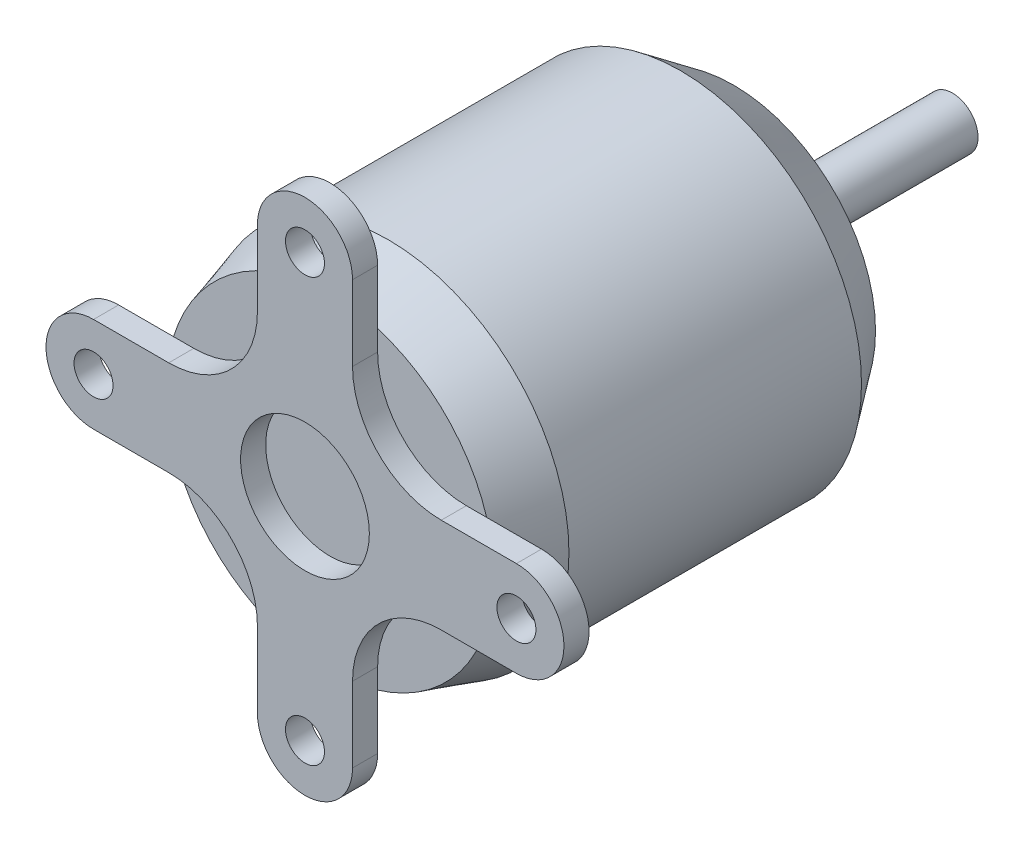
ISO-10303-21;
HEADER;
FILE_DESCRIPTION(('STEP AP214'),'2;1');
FILE_NAME('part.step','',(''),(''),'','','');
FILE_SCHEMA(('AUTOMOTIVE_DESIGN { 1 0 10303 214 1 1 1 1 }'));
ENDSEC;
DATA;
#1=APPLICATION_CONTEXT('core data for automotive mechanical design processes');
#2=APPLICATION_PROTOCOL_DEFINITION('international standard','automotive_design',2000,#1);
#3=PRODUCT_CONTEXT('',#1,'mechanical');
#4=PRODUCT('Part','Part','',(#3));
#5=PRODUCT_RELATED_PRODUCT_CATEGORY('part','',(#4));
#6=PRODUCT_DEFINITION_FORMATION('','',#4);
#7=PRODUCT_DEFINITION_CONTEXT('part definition',#1,'design');
#8=PRODUCT_DEFINITION('design','',#6,#7);
#9=PRODUCT_DEFINITION_SHAPE('','',#8);
#10=(LENGTH_UNIT() NAMED_UNIT(*) SI_UNIT(.MILLI.,.METRE.));
#11=(NAMED_UNIT(*) PLANE_ANGLE_UNIT() SI_UNIT($,.RADIAN.));
#12=(NAMED_UNIT(*) SI_UNIT($,.STERADIAN.) SOLID_ANGLE_UNIT());
#13=UNCERTAINTY_MEASURE_WITH_UNIT(LENGTH_MEASURE(1.E-05),#10,'distance_accuracy_value','');
#14=(GEOMETRIC_REPRESENTATION_CONTEXT(3) GLOBAL_UNCERTAINTY_ASSIGNED_CONTEXT((#13)) GLOBAL_UNIT_ASSIGNED_CONTEXT((#10,
#11,#12)) REPRESENTATION_CONTEXT('',''));
#15=CARTESIAN_POINT('',(0.,0.,0.));
#16=DIRECTION('',(0.,0.,1.));
#17=DIRECTION('',(1.,0.,0.));
#18=AXIS2_PLACEMENT_3D('',#15,#16,#17);
#19=CARTESIAN_POINT('',(0.,0.,0.));
#20=DIRECTION('',(0.,0.,1.));
#21=DIRECTION('',(1.,0.,0.));
#22=AXIS2_PLACEMENT_3D('',#19,#20,#21);
#23=PLANE('',#22);
#24=CARTESIAN_POINT('',(10.4834809732489,10.4834809732489,0.));
#25=DIRECTION('',(0.,0.,1.));
#26=DIRECTION('',(1.,0.,0.));
#27=AXIS2_PLACEMENT_3D('',#24,#25,#26);
#28=CIRCLE('',#27,6.82588097324893);
#29=CARTESIAN_POINT('',(3.6576,10.4834809732489,0.));
#30=VERTEX_POINT('',#29);
#31=CARTESIAN_POINT('',(10.4834809732489,3.65759999999996,0.));
#32=VERTEX_POINT('',#31);
#33=EDGE_CURVE('E51',#30,#32,#28,.T.);
#34=ORIENTED_EDGE('',*,*,#33,.T.);
#35=DIRECTION('',(-1.,0.,0.));
#36=VECTOR('',#35,1.);
#37=CARTESIAN_POINT('',(0.,3.6576,0.));
#38=LINE('',#37,#36);
#39=CARTESIAN_POINT('',(12.0425000199294,3.65759999999996,0.));
#40=VERTEX_POINT('',#39);
#41=EDGE_CURVE('E289',#40,#32,#38,.T.);
#42=ORIENTED_EDGE('',*,*,#41,.F.);
#43=CARTESIAN_POINT('',(0.,0.,0.));
#44=DIRECTION('',(0.,0.,-1.));
#45=DIRECTION('',(-1.,0.,0.));
#46=AXIS2_PLACEMENT_3D('',#43,#44,#45);
#47=CIRCLE('',#46,12.5857);
#48=CARTESIAN_POINT('',(3.6576,12.0425000199294,0.));
#49=VERTEX_POINT('',#48);
#50=EDGE_CURVE('E375',#49,#40,#47,.T.);
#51=ORIENTED_EDGE('',*,*,#50,.F.);
#52=DIRECTION('',(0.,-1.,0.));
#53=VECTOR('',#52,1.);
#54=CARTESIAN_POINT('',(3.6576,0.,0.));
#55=LINE('',#54,#53);
#56=EDGE_CURVE('E42',#49,#30,#55,.T.);
#57=ORIENTED_EDGE('',*,*,#56,.T.);
#58=EDGE_LOOP('',(#34,#42,#51,#57));
#59=FACE_BOUND('',#58,.T.);
#60=ADVANCED_FACE('F33',(#59),#23,.T.);
#61=CARTESIAN_POINT('',(0.,0.,0.));
#62=DIRECTION('',(0.,0.,1.));
#63=DIRECTION('',(1.,0.,0.));
#64=AXIS2_PLACEMENT_3D('',#61,#62,#63);
#65=CIRCLE('',#64,4.953);
#66=CARTESIAN_POINT('',(4.953,0.,0.));
#67=VERTEX_POINT('',#66);
#68=EDGE_CURVE('E324',#67,#67,#65,.T.);
#69=ORIENTED_EDGE('',*,*,#68,.T.);
#70=EDGE_LOOP('',(#69));
#71=FACE_BOUND('',#70,.T.);
#72=ADVANCED_FACE('F462',(#71),#23,.T.);
#73=DIRECTION('',(-1.,0.,0.));
#74=VECTOR('',#73,1.);
#75=CARTESIAN_POINT('',(0.,-3.6576,0.));
#76=LINE('',#75,#74);
#77=CARTESIAN_POINT('',(12.0425000199294,-3.65760000000004,0.));
#78=VERTEX_POINT('',#77);
#79=CARTESIAN_POINT('',(10.4834809732489,-3.65760000000004,0.));
#80=VERTEX_POINT('',#79);
#81=EDGE_CURVE('E59',#78,#80,#76,.T.);
#82=ORIENTED_EDGE('',*,*,#81,.T.);
#83=CARTESIAN_POINT('',(10.4834809732489,-10.483480973249,0.));
#84=DIRECTION('',(0.,0.,1.));
#85=DIRECTION('',(0.,-1.,0.));
#86=AXIS2_PLACEMENT_3D('',#83,#84,#85);
#87=CIRCLE('',#86,6.82588097324893);
#88=CARTESIAN_POINT('',(3.6576,-10.4834809732489,0.));
#89=VERTEX_POINT('',#88);
#90=EDGE_CURVE('E268',#80,#89,#87,.T.);
#91=ORIENTED_EDGE('',*,*,#90,.T.);
#92=DIRECTION('',(0.,1.,0.));
#93=VECTOR('',#92,1.);
#94=CARTESIAN_POINT('',(3.6576,0.,0.));
#95=LINE('',#94,#93);
#96=CARTESIAN_POINT('',(3.6576,-12.0425000199294,0.));
#97=VERTEX_POINT('',#96);
#98=EDGE_CURVE('E252',#97,#89,#95,.T.);
#99=ORIENTED_EDGE('',*,*,#98,.F.);
#100=EDGE_CURVE('E374',#78,#97,#47,.T.);
#101=ORIENTED_EDGE('',*,*,#100,.F.);
#102=EDGE_LOOP('',(#82,#91,#99,#101));
#103=FACE_BOUND('',#102,.T.);
#104=ADVANCED_FACE('F460',(#103),#23,.T.);
#105=DIRECTION('',(1.,0.,0.));
#106=VECTOR('',#105,1.);
#107=CARTESIAN_POINT('',(0.,3.6576,0.));
#108=LINE('',#107,#106);
#109=CARTESIAN_POINT('',(-12.0425000199294,3.65760000000013,0.));
#110=VERTEX_POINT('',#109);
#111=CARTESIAN_POINT('',(-10.4834809732489,3.65760000000011,0.));
#112=VERTEX_POINT('',#111);
#113=EDGE_CURVE('E219',#110,#112,#108,.T.);
#114=ORIENTED_EDGE('',*,*,#113,.T.);
#115=CARTESIAN_POINT('',(-10.4834809732489,10.4834809732489,0.));
#116=DIRECTION('',(0.,0.,1.));
#117=DIRECTION('',(1.,0.,0.));
#118=AXIS2_PLACEMENT_3D('',#115,#116,#117);
#119=CIRCLE('',#118,6.82588097324893);
#120=CARTESIAN_POINT('',(-3.6576,10.4834809732489,0.));
#121=VERTEX_POINT('',#120);
#122=EDGE_CURVE('E190',#121,#112,#119,.F.);
#123=ORIENTED_EDGE('',*,*,#122,.F.);
#124=DIRECTION('',(0.,-1.,0.));
#125=VECTOR('',#124,1.);
#126=CARTESIAN_POINT('',(-3.6576,0.,0.));
#127=LINE('',#126,#125);
#128=CARTESIAN_POINT('',(-3.6576,12.0425000199294,0.));
#129=VERTEX_POINT('',#128);
#130=EDGE_CURVE('E11',#129,#121,#127,.T.);
#131=ORIENTED_EDGE('',*,*,#130,.F.);
#132=EDGE_CURVE('E365',#110,#129,#47,.T.);
#133=ORIENTED_EDGE('',*,*,#132,.F.);
#134=EDGE_LOOP('',(#114,#123,#131,#133));
#135=FACE_BOUND('',#134,.T.);
#136=ADVANCED_FACE('F421',(#135),#23,.T.);
#137=DIRECTION('',(0.,1.,0.));
#138=VECTOR('',#137,1.);
#139=CARTESIAN_POINT('',(-3.6576,0.,0.));
#140=LINE('',#139,#138);
#141=CARTESIAN_POINT('',(-3.6576,-12.0425000199294,0.));
#142=VERTEX_POINT('',#141);
#143=CARTESIAN_POINT('',(-3.6576,-10.4834809732489,0.));
#144=VERTEX_POINT('',#143);
#145=EDGE_CURVE('E246',#142,#144,#140,.T.);
#146=ORIENTED_EDGE('',*,*,#145,.T.);
#147=CARTESIAN_POINT('',(-10.4834809732489,-10.4834809732489,0.));
#148=DIRECTION('',(0.,0.,1.));
#149=DIRECTION('',(-1.,0.,0.));
#150=AXIS2_PLACEMENT_3D('',#147,#148,#149);
#151=CIRCLE('',#150,6.82588097324893);
#152=CARTESIAN_POINT('',(-10.483480973249,-3.65759999999989,0.));
#153=VERTEX_POINT('',#152);
#154=EDGE_CURVE('E194',#144,#153,#151,.T.);
#155=ORIENTED_EDGE('',*,*,#154,.T.);
#156=DIRECTION('',(1.,0.,0.));
#157=VECTOR('',#156,1.);
#158=CARTESIAN_POINT('',(0.,-3.6576,0.));
#159=LINE('',#158,#157);
#160=CARTESIAN_POINT('',(-12.0425000199295,-3.65759999999987,0.));
#161=VERTEX_POINT('',#160);
#162=EDGE_CURVE('E221',#161,#153,#159,.T.);
#163=ORIENTED_EDGE('',*,*,#162,.F.);
#164=EDGE_CURVE('E368',#142,#161,#47,.T.);
#165=ORIENTED_EDGE('',*,*,#164,.F.);
#166=EDGE_LOOP('',(#146,#155,#163,#165));
#167=FACE_BOUND('',#166,.T.);
#168=ADVANCED_FACE('F35',(#167),#23,.T.);
#169=CARTESIAN_POINT('',(0.,0.,-4.4704));
#170=DIRECTION('',(0.,0.,-1.));
#171=DIRECTION('',(-1.,0.,0.));
#172=AXIS2_PLACEMENT_3D('',#169,#170,#171);
#173=CONICAL_SURFACE('',#172,13.9065,0.287281453397134);
#174=EDGE_CURVE('E37',#129,#49,#47,.T.);
#175=ORIENTED_EDGE('',*,*,#174,.T.);
#176=ORIENTED_EDGE('',*,*,#50,.T.);
#177=CARTESIAN_POINT('',(0.,0.,0.));
#178=DIRECTION('',(0.,0.,1.));
#179=DIRECTION('',(1.,0.,0.));
#180=AXIS2_PLACEMENT_3D('',#177,#178,#179);
#181=CIRCLE('',#180,12.5857);
#182=EDGE_CURVE('E304',#40,#78,#181,.F.);
#183=ORIENTED_EDGE('',*,*,#182,.T.);
#184=ORIENTED_EDGE('',*,*,#100,.T.);
#185=EDGE_CURVE('E308',#97,#142,#181,.F.);
#186=ORIENTED_EDGE('',*,*,#185,.T.);
#187=ORIENTED_EDGE('',*,*,#164,.T.);
#188=EDGE_CURVE('E307',#161,#110,#181,.F.);
#189=ORIENTED_EDGE('',*,*,#188,.T.);
#190=ORIENTED_EDGE('',*,*,#132,.T.);
#191=EDGE_LOOP('',(#175,#176,#183,#184,#186,#187,#189,#190));
#192=FACE_BOUND('',#191,.T.);
#193=CARTESIAN_POINT('',(0.,0.,-4.4704));
#194=DIRECTION('',(0.,0.,-1.));
#195=DIRECTION('',(-1.,0.,0.));
#196=AXIS2_PLACEMENT_3D('',#193,#194,#195);
#197=CIRCLE('',#196,13.9065);
#198=CARTESIAN_POINT('',(-13.9065,0.,-4.4704));
#199=VERTEX_POINT('',#198);
#200=EDGE_CURVE('E363',#199,#199,#197,.T.);
#201=ORIENTED_EDGE('',*,*,#200,.F.);
#202=EDGE_LOOP('',(#201));
#203=FACE_BOUND('',#202,.T.);
#204=ADVANCED_FACE('F383',(#192,#203),#173,.T.);
#205=CARTESIAN_POINT('',(0.,0.,0.));
#206=DIRECTION('',(0.,0.,-1.));
#207=DIRECTION('',(-1.,0.,0.));
#208=AXIS2_PLACEMENT_3D('',#205,#206,#207);
#209=CYLINDRICAL_SURFACE('',#208,13.9065);
#210=ORIENTED_EDGE('',*,*,#200,.T.);
#211=EDGE_LOOP('',(#210));
#212=FACE_BOUND('',#211,.T.);
#213=CARTESIAN_POINT('',(0.,0.,-26.9748));
#214=DIRECTION('',(0.,0.,-1.));
#215=DIRECTION('',(-1.,0.,0.));
#216=AXIS2_PLACEMENT_3D('',#213,#214,#215);
#217=CIRCLE('',#216,13.9065);
#218=CARTESIAN_POINT('',(-13.9065,0.,-26.9748));
#219=VERTEX_POINT('',#218);
#220=EDGE_CURVE('E361',#219,#219,#217,.T.);
#221=ORIENTED_EDGE('',*,*,#220,.F.);
#222=EDGE_LOOP('',(#221));
#223=FACE_BOUND('',#222,.T.);
#224=ADVANCED_FACE('F475',(#212,#223),#209,.T.);
#225=CARTESIAN_POINT('',(0.,0.,-31.0388));
#226=DIRECTION('',(0.,0.,1.));
#227=DIRECTION('',(1.,0.,0.));
#228=AXIS2_PLACEMENT_3D('',#225,#226,#227);
#229=CONICAL_SURFACE('',#228,10.922,0.633425882969144);
#230=ORIENTED_EDGE('',*,*,#220,.T.);
#231=EDGE_LOOP('',(#230));
#232=FACE_BOUND('',#231,.T.);
#233=CARTESIAN_POINT('',(0.,0.,-31.0388));
#234=DIRECTION('',(0.,0.,-1.));
#235=DIRECTION('',(-1.,0.,0.));
#236=AXIS2_PLACEMENT_3D('',#233,#234,#235);
#237=CIRCLE('',#236,10.922);
#238=CARTESIAN_POINT('',(-10.922,0.,-31.0388));
#239=VERTEX_POINT('',#238);
#240=EDGE_CURVE('E358',#239,#239,#237,.T.);
#241=ORIENTED_EDGE('',*,*,#240,.F.);
#242=EDGE_LOOP('',(#241));
#243=FACE_BOUND('',#242,.T.);
#244=ADVANCED_FACE('F479',(#232,#243),#229,.T.);
#245=CARTESIAN_POINT('',(0.,10.922,-31.0388));
#246=DIRECTION('',(0.,0.,-1.));
#247=DIRECTION('',(-1.,0.,0.));
#248=AXIS2_PLACEMENT_3D('',#245,#246,#247);
#249=PLANE('',#248);
#250=ORIENTED_EDGE('',*,*,#240,.T.);
#251=EDGE_LOOP('',(#250));
#252=FACE_BOUND('',#251,.T.);
#253=CARTESIAN_POINT('',(0.,0.,-31.0388));
#254=DIRECTION('',(0.,0.,-1.));
#255=DIRECTION('',(-1.,0.,0.));
#256=AXIS2_PLACEMENT_3D('',#253,#254,#255);
#257=CIRCLE('',#256,4.50215);
#258=CARTESIAN_POINT('',(-4.50215,0.,-31.0388));
#259=VERTEX_POINT('',#258);
#260=EDGE_CURVE('E355',#259,#259,#257,.T.);
#261=ORIENTED_EDGE('',*,*,#260,.F.);
#262=EDGE_LOOP('',(#261));
#263=FACE_BOUND('',#262,.T.);
#264=ADVANCED_FACE('F484',(#252,#263),#249,.T.);
#265=CARTESIAN_POINT('',(0.,0.,0.));
#266=DIRECTION('',(0.,0.,-1.));
#267=DIRECTION('',(-1.,0.,0.));
#268=AXIS2_PLACEMENT_3D('',#265,#266,#267);
#269=CYLINDRICAL_SURFACE('',#268,4.50215);
#270=ORIENTED_EDGE('',*,*,#260,.T.);
#271=EDGE_LOOP('',(#270));
#272=FACE_BOUND('',#271,.T.);
#273=CARTESIAN_POINT('',(0.,0.,-34.9758));
#274=DIRECTION('',(0.,0.,-1.));
#275=DIRECTION('',(-1.,0.,0.));
#276=AXIS2_PLACEMENT_3D('',#273,#274,#275);
#277=CIRCLE('',#276,4.50215);
#278=CARTESIAN_POINT('',(-4.50215,0.,-34.9758));
#279=VERTEX_POINT('',#278);
#280=EDGE_CURVE('E352',#279,#279,#277,.T.);
#281=ORIENTED_EDGE('',*,*,#280,.F.);
#282=EDGE_LOOP('',(#281));
#283=FACE_BOUND('',#282,.T.);
#284=ADVANCED_FACE('F488',(#272,#283),#269,.T.);
#285=CARTESIAN_POINT('',(0.,4.50215,-34.9758));
#286=DIRECTION('',(0.,0.,-1.));
#287=DIRECTION('',(-1.,0.,0.));
#288=AXIS2_PLACEMENT_3D('',#285,#286,#287);
#289=PLANE('',#288);
#290=ORIENTED_EDGE('',*,*,#280,.T.);
#291=EDGE_LOOP('',(#290));
#292=FACE_BOUND('',#291,.T.);
#293=CARTESIAN_POINT('',(0.,0.,-34.9758));
#294=DIRECTION('',(0.,0.,-1.));
#295=DIRECTION('',(-1.,0.,0.));
#296=AXIS2_PLACEMENT_3D('',#293,#294,#295);
#297=CIRCLE('',#296,1.9685);
#298=CARTESIAN_POINT('',(-1.9685,0.,-34.9758));
#299=VERTEX_POINT('',#298);
#300=EDGE_CURVE('E349',#299,#299,#297,.T.);
#301=ORIENTED_EDGE('',*,*,#300,.F.);
#302=EDGE_LOOP('',(#301));
#303=FACE_BOUND('',#302,.T.);
#304=ADVANCED_FACE('F492',(#292,#303),#289,.T.);
#305=CARTESIAN_POINT('',(0.,0.,0.));
#306=DIRECTION('',(0.,0.,-1.));
#307=DIRECTION('',(-1.,0.,0.));
#308=AXIS2_PLACEMENT_3D('',#305,#306,#307);
#309=CYLINDRICAL_SURFACE('',#308,1.9685);
#310=ORIENTED_EDGE('',*,*,#300,.T.);
#311=EDGE_LOOP('',(#310));
#312=FACE_BOUND('',#311,.T.);
#313=CARTESIAN_POINT('',(0.,0.,-47.879));
#314=DIRECTION('',(0.,0.,-1.));
#315=DIRECTION('',(-1.,0.,0.));
#316=AXIS2_PLACEMENT_3D('',#313,#314,#315);
#317=CIRCLE('',#316,1.9685);
#318=CARTESIAN_POINT('',(-1.9685,0.,-47.879));
#319=VERTEX_POINT('',#318);
#320=EDGE_CURVE('E346',#319,#319,#317,.T.);
#321=ORIENTED_EDGE('',*,*,#320,.F.);
#322=EDGE_LOOP('',(#321));
#323=FACE_BOUND('',#322,.T.);
#324=ADVANCED_FACE('F496',(#312,#323),#309,.T.);
#325=CARTESIAN_POINT('',(0.,1.9685,-47.879));
#326=DIRECTION('',(0.,0.,-1.));
#327=DIRECTION('',(-1.,0.,0.));
#328=AXIS2_PLACEMENT_3D('',#325,#326,#327);
#329=PLANE('',#328);
#330=ORIENTED_EDGE('',*,*,#320,.T.);
#331=EDGE_LOOP('',(#330));
#332=FACE_BOUND('',#331,.T.);
#333=ADVANCED_FACE('F500',(#332),#329,.T.);
#334=CARTESIAN_POINT('',(0.,0.,1.9304));
#335=DIRECTION('',(0.,0.,-1.));
#336=DIRECTION('',(-1.,0.,0.));
#337=AXIS2_PLACEMENT_3D('',#334,#335,#336);
#338=CYLINDRICAL_SURFACE('',#337,4.953);
#339=ORIENTED_EDGE('',*,*,#68,.F.);
#340=EDGE_LOOP('',(#339));
#341=FACE_BOUND('',#340,.T.);
#342=CARTESIAN_POINT('',(0.,0.,1.9304));
#343=DIRECTION('',(0.,0.,1.));
#344=DIRECTION('',(1.,0.,0.));
#345=AXIS2_PLACEMENT_3D('',#342,#343,#344);
#346=CIRCLE('',#345,4.953);
#347=CARTESIAN_POINT('',(4.953,0.,1.9304));
#348=VERTEX_POINT('',#347);
#349=EDGE_CURVE('E309',#348,#348,#346,.T.);
#350=ORIENTED_EDGE('',*,*,#349,.T.);
#351=EDGE_LOOP('',(#350));
#352=FACE_BOUND('',#351,.T.);
#353=ADVANCED_FACE('F504',(#341,#352),#338,.F.);
#354=CARTESIAN_POINT('',(10.4834809732489,10.4834809732489,1.9304));
#355=DIRECTION('',(0.,0.,-1.));
#356=DIRECTION('',(-1.,0.,0.));
#357=AXIS2_PLACEMENT_3D('',#354,#355,#356);
#358=CYLINDRICAL_SURFACE('',#357,6.82588097324893);
#359=ORIENTED_EDGE('',*,*,#33,.F.);
#360=DIRECTION('',(0.,0.,-1.));
#361=VECTOR('',#360,1.);
#362=CARTESIAN_POINT('',(3.6576,10.4834809732489,1.9304));
#363=LINE('',#362,#361);
#364=CARTESIAN_POINT('',(3.6576,10.4834809732489,1.9304));
#365=VERTEX_POINT('',#364);
#366=EDGE_CURVE('E343',#365,#30,#363,.T.);
#367=ORIENTED_EDGE('',*,*,#366,.F.);
#368=CARTESIAN_POINT('',(10.4834809732489,10.4834809732489,1.9304));
#369=DIRECTION('',(0.,0.,1.));
#370=DIRECTION('',(1.,0.,0.));
#371=AXIS2_PLACEMENT_3D('',#368,#369,#370);
#372=CIRCLE('',#371,6.82588097324893);
#373=CARTESIAN_POINT('',(10.4834809732489,3.65759999999996,1.9304));
#374=VERTEX_POINT('',#373);
#375=EDGE_CURVE('E312',#365,#374,#372,.T.);
#376=ORIENTED_EDGE('',*,*,#375,.T.);
#377=DIRECTION('',(0.,0.,-1.));
#378=VECTOR('',#377,1.);
#379=CARTESIAN_POINT('',(10.4834809732489,3.65759999999996,1.9304));
#380=LINE('',#379,#378);
#381=EDGE_CURVE('E282',#374,#32,#380,.T.);
#382=ORIENTED_EDGE('',*,*,#381,.T.);
#383=EDGE_LOOP('',(#359,#367,#376,#382));
#384=FACE_BOUND('',#383,.T.);
#385=ADVANCED_FACE('F443',(#384),#358,.F.);
#386=CARTESIAN_POINT('',(3.6576,0.,1.9304));
#387=DIRECTION('',(1.,0.,0.));
#388=DIRECTION('',(0.,1.,0.));
#389=AXIS2_PLACEMENT_3D('',#386,#387,#388);
#390=PLANE('',#389);
#391=CARTESIAN_POINT('',(3.6576,16.265,0.));
#392=VERTEX_POINT('',#391);
#393=EDGE_CURVE('E328',#392,#49,#55,.T.);
#394=ORIENTED_EDGE('',*,*,#393,.F.);
#395=DIRECTION('',(0.,0.,-1.));
#396=VECTOR('',#395,1.);
#397=CARTESIAN_POINT('',(3.6576,16.265,1.9304));
#398=LINE('',#397,#396);
#399=CARTESIAN_POINT('',(3.6576,16.265,1.9304));
#400=VERTEX_POINT('',#399);
#401=EDGE_CURVE('E341',#400,#392,#398,.T.);
#402=ORIENTED_EDGE('',*,*,#401,.F.);
#403=DIRECTION('',(0.,-1.,0.));
#404=VECTOR('',#403,1.);
#405=CARTESIAN_POINT('',(3.6576,0.,1.9304));
#406=LINE('',#405,#404);
#407=EDGE_CURVE('E315',#400,#365,#406,.T.);
#408=ORIENTED_EDGE('',*,*,#407,.T.);
#409=ORIENTED_EDGE('',*,*,#366,.T.);
#410=ORIENTED_EDGE('',*,*,#56,.F.);
#411=EDGE_LOOP('',(#394,#402,#408,#409,#410));
#412=FACE_BOUND('',#411,.T.);
#413=ADVANCED_FACE('F436',(#412),#390,.T.);
#414=CARTESIAN_POINT('',(0.,16.265,1.9304));
#415=DIRECTION('',(0.,0.,-1.));
#416=DIRECTION('',(-1.,0.,0.));
#417=AXIS2_PLACEMENT_3D('',#414,#415,#416);
#418=CYLINDRICAL_SURFACE('',#417,3.6576);
#419=CARTESIAN_POINT('',(0.,16.265,0.));
#420=DIRECTION('',(0.,0.,1.));
#421=DIRECTION('',(1.,0.,0.));
#422=AXIS2_PLACEMENT_3D('',#419,#420,#421);
#423=CIRCLE('',#422,3.6576);
#424=CARTESIAN_POINT('',(-3.6576,16.265,0.));
#425=VERTEX_POINT('',#424);
#426=EDGE_CURVE('E331',#392,#425,#423,.T.);
#427=ORIENTED_EDGE('',*,*,#426,.T.);
#428=DIRECTION('',(0.,0.,-1.));
#429=VECTOR('',#428,1.);
#430=CARTESIAN_POINT('',(-3.6576,16.265,1.9304));
#431=LINE('',#430,#429);
#432=CARTESIAN_POINT('',(-3.6576,16.265,1.9304));
#433=VERTEX_POINT('',#432);
#434=EDGE_CURVE('E338',#433,#425,#431,.T.);
#435=ORIENTED_EDGE('',*,*,#434,.F.);
#436=CARTESIAN_POINT('',(0.,16.265,1.9304));
#437=DIRECTION('',(0.,0.,1.));
#438=DIRECTION('',(1.,0.,0.));
#439=AXIS2_PLACEMENT_3D('',#436,#437,#438);
#440=CIRCLE('',#439,3.6576);
#441=EDGE_CURVE('E318',#400,#433,#440,.T.);
#442=ORIENTED_EDGE('',*,*,#441,.F.);
#443=ORIENTED_EDGE('',*,*,#401,.T.);
#444=EDGE_LOOP('',(#427,#435,#442,#443));
#445=FACE_BOUND('',#444,.T.);
#446=ADVANCED_FACE('F433',(#445),#418,.T.);
#447=CARTESIAN_POINT('',(-3.6576,0.,1.9304));
#448=DIRECTION('',(1.,0.,0.));
#449=DIRECTION('',(0.,0.,-1.));
#450=AXIS2_PLACEMENT_3D('',#447,#448,#449);
#451=PLANE('',#450);
#452=EDGE_CURVE('E44',#425,#129,#127,.T.);
#453=ORIENTED_EDGE('',*,*,#452,.T.);
#454=ORIENTED_EDGE('',*,*,#130,.T.);
#455=DIRECTION('',(0.,0.,-1.));
#456=VECTOR('',#455,1.);
#457=CARTESIAN_POINT('',(-3.6576,10.4834809732489,1.9304));
#458=LINE('',#457,#456);
#459=CARTESIAN_POINT('',(-3.6576,10.4834809732489,1.9304));
#460=VERTEX_POINT('',#459);
#461=EDGE_CURVE('E323',#460,#121,#458,.T.);
#462=ORIENTED_EDGE('',*,*,#461,.F.);
#463=DIRECTION('',(0.,-1.,0.));
#464=VECTOR('',#463,1.);
#465=CARTESIAN_POINT('',(-3.6576,0.,1.9304));
#466=LINE('',#465,#464);
#467=EDGE_CURVE('E181',#433,#460,#466,.T.);
#468=ORIENTED_EDGE('',*,*,#467,.F.);
#469=ORIENTED_EDGE('',*,*,#434,.T.);
#470=EDGE_LOOP('',(#453,#454,#462,#468,#469));
#471=FACE_BOUND('',#470,.T.);
#472=ADVANCED_FACE('F429',(#471),#451,.F.);
#473=CARTESIAN_POINT('',(-10.4834809732489,10.4834809732489,1.9304));
#474=DIRECTION('',(0.,0.,-1.));
#475=DIRECTION('',(-1.,0.,0.));
#476=AXIS2_PLACEMENT_3D('',#473,#474,#475);
#477=CYLINDRICAL_SURFACE('',#476,6.82588097324893);
#478=ORIENTED_EDGE('',*,*,#122,.T.);
#479=DIRECTION('',(0.,0.,-1.));
#480=VECTOR('',#479,1.);
#481=CARTESIAN_POINT('',(-10.4834809732489,3.65760000000011,1.9304));
#482=LINE('',#481,#480);
#483=CARTESIAN_POINT('',(-10.4834809732489,3.65760000000011,1.9304));
#484=VERTEX_POINT('',#483);
#485=EDGE_CURVE('E188',#484,#112,#482,.T.);
#486=ORIENTED_EDGE('',*,*,#485,.F.);
#487=CARTESIAN_POINT('',(-10.4834809732489,10.4834809732489,1.9304));
#488=DIRECTION('',(0.,0.,1.));
#489=DIRECTION('',(1.,0.,0.));
#490=AXIS2_PLACEMENT_3D('',#487,#488,#489);
#491=CIRCLE('',#490,6.82588097324893);
#492=EDGE_CURVE('E173',#460,#484,#491,.F.);
#493=ORIENTED_EDGE('',*,*,#492,.F.);
#494=ORIENTED_EDGE('',*,*,#461,.T.);
#495=EDGE_LOOP('',(#478,#486,#493,#494));
#496=FACE_BOUND('',#495,.T.);
#497=ADVANCED_FACE('F189',(#496),#477,.F.);
#498=CARTESIAN_POINT('',(0.,16.265,1.9304));
#499=DIRECTION('',(0.,0.,-1.));
#500=DIRECTION('',(-1.,0.,0.));
#501=AXIS2_PLACEMENT_3D('',#498,#499,#500);
#502=CYLINDRICAL_SURFACE('',#501,1.5);
#503=CARTESIAN_POINT('',(0.,16.265,1.9304));
#504=DIRECTION('',(0.,0.,1.));
#505=DIRECTION('',(1.,0.,0.));
#506=AXIS2_PLACEMENT_3D('',#503,#504,#505);
#507=CIRCLE('',#506,1.5);
#508=CARTESIAN_POINT('',(1.5,16.265,1.9304));
#509=VERTEX_POINT('',#508);
#510=EDGE_CURVE('E185',#509,#509,#507,.T.);
#511=ORIENTED_EDGE('',*,*,#510,.T.);
#512=EDGE_LOOP('',(#511));
#513=FACE_BOUND('',#512,.T.);
#514=CARTESIAN_POINT('',(0.,16.265,0.));
#515=DIRECTION('',(0.,0.,1.));
#516=DIRECTION('',(1.,0.,0.));
#517=AXIS2_PLACEMENT_3D('',#514,#515,#516);
#518=CIRCLE('',#517,1.5);
#519=CARTESIAN_POINT('',(1.5,16.265,0.));
#520=VERTEX_POINT('',#519);
#521=EDGE_CURVE('E313',#520,#520,#518,.T.);
#522=ORIENTED_EDGE('',*,*,#521,.F.);
#523=EDGE_LOOP('',(#522));
#524=FACE_BOUND('',#523,.T.);
#525=ADVANCED_FACE('F519',(#513,#524),#502,.F.);
#526=CARTESIAN_POINT('',(0.,0.,1.9304));
#527=DIRECTION('',(0.,0.,1.));
#528=DIRECTION('',(1.,0.,0.));
#529=AXIS2_PLACEMENT_3D('',#526,#527,#528);
#530=PLANE('',#529);
#531=DIRECTION('',(-1.,0.,0.));
#532=VECTOR('',#531,1.);
#533=CARTESIAN_POINT('',(0.,3.6576,1.9304));
#534=LINE('',#533,#532);
#535=CARTESIAN_POINT('',(16.265,3.65759999999994,1.9304));
#536=VERTEX_POINT('',#535);
#537=EDGE_CURVE('E277',#536,#374,#534,.T.);
#538=ORIENTED_EDGE('',*,*,#537,.T.);
#539=ORIENTED_EDGE('',*,*,#375,.F.);
#540=ORIENTED_EDGE('',*,*,#407,.F.);
#541=ORIENTED_EDGE('',*,*,#441,.T.);
#542=ORIENTED_EDGE('',*,*,#467,.T.);
#543=ORIENTED_EDGE('',*,*,#492,.T.);
#544=DIRECTION('',(1.,0.,0.));
#545=VECTOR('',#544,1.);
#546=CARTESIAN_POINT('',(0.,3.6576,1.9304));
#547=LINE('',#546,#545);
#548=CARTESIAN_POINT('',(-16.265,3.65760000000017,1.9304));
#549=VERTEX_POINT('',#548);
#550=EDGE_CURVE('E179',#549,#484,#547,.T.);
#551=ORIENTED_EDGE('',*,*,#550,.F.);
#552=CARTESIAN_POINT('',(-16.265,1.70366831928851E-13,1.9304));
#553=DIRECTION('',(0.,0.,1.));
#554=DIRECTION('',(0.,1.,0.));
#555=AXIS2_PLACEMENT_3D('',#552,#553,#554);
#556=CIRCLE('',#555,3.6576);
#557=CARTESIAN_POINT('',(-16.265,-3.65759999999983,1.9304));
#558=VERTEX_POINT('',#557);
#559=EDGE_CURVE('E200',#549,#558,#556,.T.);
#560=ORIENTED_EDGE('',*,*,#559,.T.);
#561=DIRECTION('',(1.,0.,0.));
#562=VECTOR('',#561,1.);
#563=CARTESIAN_POINT('',(0.,-3.6576,1.9304));
#564=LINE('',#563,#562);
#565=CARTESIAN_POINT('',(-10.483480973249,-3.65759999999989,1.9304));
#566=VERTEX_POINT('',#565);
#567=EDGE_CURVE('E203',#558,#566,#564,.T.);
#568=ORIENTED_EDGE('',*,*,#567,.T.);
#569=CARTESIAN_POINT('',(-10.4834809732489,-10.4834809732489,1.9304));
#570=DIRECTION('',(0.,0.,1.));
#571=DIRECTION('',(-1.,0.,0.));
#572=AXIS2_PLACEMENT_3D('',#569,#570,#571);
#573=CIRCLE('',#572,6.82588097324893);
#574=CARTESIAN_POINT('',(-3.6576,-10.4834809732489,1.9304));
#575=VERTEX_POINT('',#574);
#576=EDGE_CURVE('E230',#575,#566,#573,.T.);
#577=ORIENTED_EDGE('',*,*,#576,.F.);
#578=DIRECTION('',(0.,1.,0.));
#579=VECTOR('',#578,1.);
#580=CARTESIAN_POINT('',(-3.6576,0.,1.9304));
#581=LINE('',#580,#579);
#582=CARTESIAN_POINT('',(-3.6576,-16.265,1.9304));
#583=VERTEX_POINT('',#582);
#584=EDGE_CURVE('E232',#583,#575,#581,.T.);
#585=ORIENTED_EDGE('',*,*,#584,.F.);
#586=CARTESIAN_POINT('',(0.,-16.265,1.9304));
#587=DIRECTION('',(0.,0.,1.));
#588=DIRECTION('',(-1.,0.,0.));
#589=AXIS2_PLACEMENT_3D('',#586,#587,#588);
#590=CIRCLE('',#589,3.6576);
#591=CARTESIAN_POINT('',(3.6576,-16.265,1.9304));
#592=VERTEX_POINT('',#591);
#593=EDGE_CURVE('E236',#583,#592,#590,.T.);
#594=ORIENTED_EDGE('',*,*,#593,.T.);
#595=DIRECTION('',(0.,1.,0.));
#596=VECTOR('',#595,1.);
#597=CARTESIAN_POINT('',(3.6576,0.,1.9304));
#598=LINE('',#597,#596);
#599=CARTESIAN_POINT('',(3.6576,-10.4834809732489,1.9304));
#600=VERTEX_POINT('',#599);
#601=EDGE_CURVE('E238',#592,#600,#598,.T.);
#602=ORIENTED_EDGE('',*,*,#601,.T.);
#603=CARTESIAN_POINT('',(10.4834809732489,-10.483480973249,1.9304));
#604=DIRECTION('',(0.,0.,1.));
#605=DIRECTION('',(0.,-1.,0.));
#606=AXIS2_PLACEMENT_3D('',#603,#604,#605);
#607=CIRCLE('',#606,6.82588097324893);
#608=CARTESIAN_POINT('',(10.4834809732489,-3.65760000000004,1.9304));
#609=VERTEX_POINT('',#608);
#610=EDGE_CURVE('E269',#609,#600,#607,.T.);
#611=ORIENTED_EDGE('',*,*,#610,.F.);
#612=DIRECTION('',(-1.,0.,0.));
#613=VECTOR('',#612,1.);
#614=CARTESIAN_POINT('',(0.,-3.6576,1.9304));
#615=LINE('',#614,#613);
#616=CARTESIAN_POINT('',(16.265,-3.65760000000006,1.9304));
#617=VERTEX_POINT('',#616);
#618=EDGE_CURVE('E271',#617,#609,#615,.T.);
#619=ORIENTED_EDGE('',*,*,#618,.F.);
#620=CARTESIAN_POINT('',(16.265,0.,1.9304));
#621=DIRECTION('',(0.,0.,1.));
#622=DIRECTION('',(0.,-1.,0.));
#623=AXIS2_PLACEMENT_3D('',#620,#621,#622);
#624=CIRCLE('',#623,3.6576);
#625=EDGE_CURVE('E275',#617,#536,#624,.T.);
#626=ORIENTED_EDGE('',*,*,#625,.T.);
#627=EDGE_LOOP('',(#538,#539,#540,#541,#542,#543,#551,#560,#568,#577,#585,#594,#602,#611,#619,#626));
#628=FACE_BOUND('',#627,.T.);
#629=ORIENTED_EDGE('',*,*,#349,.F.);
#630=EDGE_LOOP('',(#629));
#631=FACE_BOUND('',#630,.T.);
#632=ORIENTED_EDGE('',*,*,#510,.F.);
#633=EDGE_LOOP('',(#632));
#634=FACE_BOUND('',#633,.T.);
#635=CARTESIAN_POINT('',(16.265,0.,1.9304));
#636=DIRECTION('',(0.,0.,1.));
#637=DIRECTION('',(0.,-1.,0.));
#638=AXIS2_PLACEMENT_3D('',#635,#636,#637);
#639=CIRCLE('',#638,1.5);
#640=CARTESIAN_POINT('',(16.265,-1.50000000000006,1.9304));
#641=VERTEX_POINT('',#640);
#642=EDGE_CURVE('E279',#641,#641,#639,.T.);
#643=ORIENTED_EDGE('',*,*,#642,.F.);
#644=EDGE_LOOP('',(#643));
#645=FACE_BOUND('',#644,.T.);
#646=CARTESIAN_POINT('',(0.,-16.265,1.9304));
#647=DIRECTION('',(0.,0.,1.));
#648=DIRECTION('',(-1.,0.,0.));
#649=AXIS2_PLACEMENT_3D('',#646,#647,#648);
#650=CIRCLE('',#649,1.5);
#651=CARTESIAN_POINT('',(-1.5,-16.265,1.9304));
#652=VERTEX_POINT('',#651);
#653=EDGE_CURVE('E241',#652,#652,#650,.T.);
#654=ORIENTED_EDGE('',*,*,#653,.F.);
#655=EDGE_LOOP('',(#654));
#656=FACE_BOUND('',#655,.T.);
#657=CARTESIAN_POINT('',(-16.265,1.70366831928851E-13,1.9304));
#658=DIRECTION('',(0.,0.,1.));
#659=DIRECTION('',(0.,1.,0.));
#660=AXIS2_PLACEMENT_3D('',#657,#658,#659);
#661=CIRCLE('',#660,1.5);
#662=CARTESIAN_POINT('',(-16.265,1.50000000000017,1.9304));
#663=VERTEX_POINT('',#662);
#664=EDGE_CURVE('E211',#663,#663,#661,.T.);
#665=ORIENTED_EDGE('',*,*,#664,.F.);
#666=EDGE_LOOP('',(#665));
#667=FACE_BOUND('',#666,.T.);
#668=ADVANCED_FACE('F176',(#628,#631,#634,#645,#656,#667),#530,.T.);
#669=CARTESIAN_POINT('',(0.,0.,0.));
#670=DIRECTION('',(0.,0.,1.));
#671=DIRECTION('',(1.,0.,0.));
#672=AXIS2_PLACEMENT_3D('',#669,#670,#671);
#673=PLANE('',#672);
#674=ORIENTED_EDGE('',*,*,#174,.F.);
#675=ORIENTED_EDGE('',*,*,#452,.F.);
#676=ORIENTED_EDGE('',*,*,#426,.F.);
#677=ORIENTED_EDGE('',*,*,#393,.T.);
#678=EDGE_LOOP('',(#674,#675,#676,#677));
#679=FACE_BOUND('',#678,.T.);
#680=ORIENTED_EDGE('',*,*,#521,.T.);
#681=EDGE_LOOP('',(#680));
#682=FACE_BOUND('',#681,.T.);
#683=ADVANCED_FACE('F425',(#679,#682),#673,.F.);
#684=CARTESIAN_POINT('',(0.,0.,0.));
#685=DIRECTION('',(0.,0.,1.));
#686=DIRECTION('',(0.,-1.,0.));
#687=AXIS2_PLACEMENT_3D('',#684,#685,#686);
#688=PLANE('',#687);
#689=ORIENTED_EDGE('',*,*,#185,.F.);
#690=CARTESIAN_POINT('',(3.6576,-16.265,0.));
#691=VERTEX_POINT('',#690);
#692=EDGE_CURVE('E253',#691,#97,#95,.T.);
#693=ORIENTED_EDGE('',*,*,#692,.F.);
#694=CARTESIAN_POINT('',(0.,-16.265,0.));
#695=DIRECTION('',(0.,0.,1.));
#696=DIRECTION('',(-1.,0.,0.));
#697=AXIS2_PLACEMENT_3D('',#694,#695,#696);
#698=CIRCLE('',#697,3.6576);
#699=CARTESIAN_POINT('',(-3.6576,-16.265,0.));
#700=VERTEX_POINT('',#699);
#701=EDGE_CURVE('E250',#700,#691,#698,.T.);
#702=ORIENTED_EDGE('',*,*,#701,.F.);
#703=EDGE_CURVE('E247',#700,#142,#140,.T.);
#704=ORIENTED_EDGE('',*,*,#703,.T.);
#705=EDGE_LOOP('',(#689,#693,#702,#704));
#706=FACE_BOUND('',#705,.T.);
#707=CARTESIAN_POINT('',(0.,-16.265,0.));
#708=DIRECTION('',(0.,0.,1.));
#709=DIRECTION('',(-1.,0.,0.));
#710=AXIS2_PLACEMENT_3D('',#707,#708,#709);
#711=CIRCLE('',#710,1.5);
#712=CARTESIAN_POINT('',(-1.5,-16.265,0.));
#713=VERTEX_POINT('',#712);
#714=EDGE_CURVE('E233',#713,#713,#711,.T.);
#715=ORIENTED_EDGE('',*,*,#714,.T.);
#716=EDGE_LOOP('',(#715));
#717=FACE_BOUND('',#716,.T.);
#718=ADVANCED_FACE('F388',(#706,#717),#688,.F.);
#719=ORIENTED_EDGE('',*,*,#188,.F.);
#720=CARTESIAN_POINT('',(-16.265,-3.65759999999983,0.));
#721=VERTEX_POINT('',#720);
#722=EDGE_CURVE('E206',#721,#161,#159,.T.);
#723=ORIENTED_EDGE('',*,*,#722,.F.);
#724=CARTESIAN_POINT('',(-16.265,1.70366831928851E-13,0.));
#725=DIRECTION('',(0.,0.,1.));
#726=DIRECTION('',(0.,1.,0.));
#727=AXIS2_PLACEMENT_3D('',#724,#725,#726);
#728=CIRCLE('',#727,3.6576);
#729=CARTESIAN_POINT('',(-16.265,3.65760000000017,0.));
#730=VERTEX_POINT('',#729);
#731=EDGE_CURVE('E218',#730,#721,#728,.T.);
#732=ORIENTED_EDGE('',*,*,#731,.F.);
#733=EDGE_CURVE('E215',#730,#110,#108,.T.);
#734=ORIENTED_EDGE('',*,*,#733,.T.);
#735=EDGE_LOOP('',(#719,#723,#732,#734));
#736=FACE_BOUND('',#735,.T.);
#737=CARTESIAN_POINT('',(-16.265,1.70366831928851E-13,0.));
#738=DIRECTION('',(0.,0.,1.));
#739=DIRECTION('',(0.,1.,0.));
#740=AXIS2_PLACEMENT_3D('',#737,#738,#739);
#741=CIRCLE('',#740,1.5);
#742=CARTESIAN_POINT('',(-16.265,1.50000000000017,0.));
#743=VERTEX_POINT('',#742);
#744=EDGE_CURVE('E201',#743,#743,#741,.T.);
#745=ORIENTED_EDGE('',*,*,#744,.T.);
#746=EDGE_LOOP('',(#745));
#747=FACE_BOUND('',#746,.T.);
#748=ADVANCED_FACE('F410',(#736,#747),#688,.F.);
#749=CARTESIAN_POINT('',(10.4834809732489,-10.483480973249,1.9304));
#750=DIRECTION('',(0.,0.,-1.));
#751=DIRECTION('',(-1.,0.,0.));
#752=AXIS2_PLACEMENT_3D('',#749,#750,#751);
#753=CYLINDRICAL_SURFACE('',#752,6.82588097324893);
#754=ORIENTED_EDGE('',*,*,#90,.F.);
#755=DIRECTION('',(0.,0.,-1.));
#756=VECTOR('',#755,1.);
#757=CARTESIAN_POINT('',(10.4834809732489,-3.65760000000004,1.9304));
#758=LINE('',#757,#756);
#759=EDGE_CURVE('E302',#609,#80,#758,.T.);
#760=ORIENTED_EDGE('',*,*,#759,.F.);
#761=ORIENTED_EDGE('',*,*,#610,.T.);
#762=DIRECTION('',(0.,0.,-1.));
#763=VECTOR('',#762,1.);
#764=CARTESIAN_POINT('',(3.6576,-10.4834809732489,1.9304));
#765=LINE('',#764,#763);
#766=EDGE_CURVE('E244',#600,#89,#765,.T.);
#767=ORIENTED_EDGE('',*,*,#766,.T.);
#768=EDGE_LOOP('',(#754,#760,#761,#767));
#769=FACE_BOUND('',#768,.T.);
#770=ADVANCED_FACE('F459',(#769),#753,.F.);
#771=CARTESIAN_POINT('',(0.,-3.6576,1.9304));
#772=DIRECTION('',(0.,-1.,0.));
#773=DIRECTION('',(1.,0.,0.));
#774=AXIS2_PLACEMENT_3D('',#771,#772,#773);
#775=PLANE('',#774);
#776=CARTESIAN_POINT('',(16.265,-3.65760000000006,0.));
#777=VERTEX_POINT('',#776);
#778=EDGE_CURVE('E284',#777,#78,#76,.T.);
#779=ORIENTED_EDGE('',*,*,#778,.F.);
#780=DIRECTION('',(0.,0.,-1.));
#781=VECTOR('',#780,1.);
#782=CARTESIAN_POINT('',(16.265,-3.65760000000006,1.9304));
#783=LINE('',#782,#781);
#784=EDGE_CURVE('E300',#617,#777,#783,.T.);
#785=ORIENTED_EDGE('',*,*,#784,.F.);
#786=ORIENTED_EDGE('',*,*,#618,.T.);
#787=ORIENTED_EDGE('',*,*,#759,.T.);
#788=ORIENTED_EDGE('',*,*,#81,.F.);
#789=EDGE_LOOP('',(#779,#785,#786,#787,#788));
#790=FACE_BOUND('',#789,.T.);
#791=ADVANCED_FACE('F455',(#790),#775,.T.);
#792=CARTESIAN_POINT('',(16.265,0.,1.9304));
#793=DIRECTION('',(0.,0.,-1.));
#794=DIRECTION('',(-1.,0.,0.));
#795=AXIS2_PLACEMENT_3D('',#792,#793,#794);
#796=CYLINDRICAL_SURFACE('',#795,3.6576);
#797=CARTESIAN_POINT('',(16.265,0.,0.));
#798=DIRECTION('',(0.,0.,1.));
#799=DIRECTION('',(0.,-1.,0.));
#800=AXIS2_PLACEMENT_3D('',#797,#798,#799);
#801=CIRCLE('',#800,3.6576);
#802=CARTESIAN_POINT('',(16.265,3.65759999999994,0.));
#803=VERTEX_POINT('',#802);
#804=EDGE_CURVE('E287',#777,#803,#801,.T.);
#805=ORIENTED_EDGE('',*,*,#804,.T.);
#806=DIRECTION('',(0.,0.,-1.));
#807=VECTOR('',#806,1.);
#808=CARTESIAN_POINT('',(16.265,3.65759999999994,1.9304));
#809=LINE('',#808,#807);
#810=EDGE_CURVE('E297',#536,#803,#809,.T.);
#811=ORIENTED_EDGE('',*,*,#810,.F.);
#812=ORIENTED_EDGE('',*,*,#625,.F.);
#813=ORIENTED_EDGE('',*,*,#784,.T.);
#814=EDGE_LOOP('',(#805,#811,#812,#813));
#815=FACE_BOUND('',#814,.T.);
#816=ADVANCED_FACE('F531',(#815),#796,.T.);
#817=CARTESIAN_POINT('',(0.,3.6576,1.9304));
#818=DIRECTION('',(0.,-1.,0.));
#819=DIRECTION('',(1.,0.,0.));
#820=AXIS2_PLACEMENT_3D('',#817,#818,#819);
#821=PLANE('',#820);
#822=EDGE_CURVE('E290',#803,#40,#38,.T.);
#823=ORIENTED_EDGE('',*,*,#822,.T.);
#824=ORIENTED_EDGE('',*,*,#41,.T.);
#825=ORIENTED_EDGE('',*,*,#381,.F.);
#826=ORIENTED_EDGE('',*,*,#537,.F.);
#827=ORIENTED_EDGE('',*,*,#810,.T.);
#828=EDGE_LOOP('',(#823,#824,#825,#826,#827));
#829=FACE_BOUND('',#828,.T.);
#830=ADVANCED_FACE('F439',(#829),#821,.F.);
#831=CARTESIAN_POINT('',(16.265,0.,1.9304));
#832=DIRECTION('',(0.,0.,-1.));
#833=DIRECTION('',(-1.,0.,0.));
#834=AXIS2_PLACEMENT_3D('',#831,#832,#833);
#835=CYLINDRICAL_SURFACE('',#834,1.5);
#836=ORIENTED_EDGE('',*,*,#642,.T.);
#837=EDGE_LOOP('',(#836));
#838=FACE_BOUND('',#837,.T.);
#839=CARTESIAN_POINT('',(16.265,0.,0.));
#840=DIRECTION('',(0.,0.,1.));
#841=DIRECTION('',(0.,-1.,0.));
#842=AXIS2_PLACEMENT_3D('',#839,#840,#841);
#843=CIRCLE('',#842,1.5);
#844=CARTESIAN_POINT('',(16.265,-1.50000000000006,0.));
#845=VERTEX_POINT('',#844);
#846=EDGE_CURVE('E272',#845,#845,#843,.T.);
#847=ORIENTED_EDGE('',*,*,#846,.F.);
#848=EDGE_LOOP('',(#847));
#849=FACE_BOUND('',#848,.T.);
#850=ADVANCED_FACE('F536',(#838,#849),#835,.F.);
#851=ORIENTED_EDGE('',*,*,#182,.F.);
#852=ORIENTED_EDGE('',*,*,#822,.F.);
#853=ORIENTED_EDGE('',*,*,#804,.F.);
#854=ORIENTED_EDGE('',*,*,#778,.T.);
#855=EDGE_LOOP('',(#851,#852,#853,#854));
#856=FACE_BOUND('',#855,.T.);
#857=ORIENTED_EDGE('',*,*,#846,.T.);
#858=EDGE_LOOP('',(#857));
#859=FACE_BOUND('',#858,.T.);
#860=ADVANCED_FACE('F451',(#856,#859),#688,.F.);
#861=CARTESIAN_POINT('',(-10.4834809732489,-10.4834809732489,1.9304));
#862=DIRECTION('',(0.,0.,-1.));
#863=DIRECTION('',(-1.,0.,0.));
#864=AXIS2_PLACEMENT_3D('',#861,#862,#863);
#865=CYLINDRICAL_SURFACE('',#864,6.82588097324893);
#866=ORIENTED_EDGE('',*,*,#154,.F.);
#867=DIRECTION('',(0.,0.,-1.));
#868=VECTOR('',#867,1.);
#869=CARTESIAN_POINT('',(-3.6576,-10.4834809732489,1.9304));
#870=LINE('',#869,#868);
#871=EDGE_CURVE('E265',#575,#144,#870,.T.);
#872=ORIENTED_EDGE('',*,*,#871,.F.);
#873=ORIENTED_EDGE('',*,*,#576,.T.);
#874=DIRECTION('',(0.,0.,-1.));
#875=VECTOR('',#874,1.);
#876=CARTESIAN_POINT('',(-10.483480973249,-3.65759999999989,1.9304));
#877=LINE('',#876,#875);
#878=EDGE_CURVE('E214',#566,#153,#877,.T.);
#879=ORIENTED_EDGE('',*,*,#878,.T.);
#880=EDGE_LOOP('',(#866,#872,#873,#879));
#881=FACE_BOUND('',#880,.T.);
#882=ADVANCED_FACE('F542',(#881),#865,.F.);
#883=CARTESIAN_POINT('',(-3.6576,0.,1.9304));
#884=DIRECTION('',(-1.,0.,0.));
#885=DIRECTION('',(0.,-1.,0.));
#886=AXIS2_PLACEMENT_3D('',#883,#884,#885);
#887=PLANE('',#886);
#888=ORIENTED_EDGE('',*,*,#703,.F.);
#889=DIRECTION('',(0.,0.,-1.));
#890=VECTOR('',#889,1.);
#891=CARTESIAN_POINT('',(-3.6576,-16.265,1.9304));
#892=LINE('',#891,#890);
#893=EDGE_CURVE('E263',#583,#700,#892,.T.);
#894=ORIENTED_EDGE('',*,*,#893,.F.);
#895=ORIENTED_EDGE('',*,*,#584,.T.);
#896=ORIENTED_EDGE('',*,*,#871,.T.);
#897=ORIENTED_EDGE('',*,*,#145,.F.);
#898=EDGE_LOOP('',(#888,#894,#895,#896,#897));
#899=FACE_BOUND('',#898,.T.);
#900=ADVANCED_FACE('F403',(#899),#887,.T.);
#901=CARTESIAN_POINT('',(0.,-16.265,1.9304));
#902=DIRECTION('',(0.,0.,-1.));
#903=DIRECTION('',(-1.,0.,0.));
#904=AXIS2_PLACEMENT_3D('',#901,#902,#903);
#905=CYLINDRICAL_SURFACE('',#904,3.6576);
#906=ORIENTED_EDGE('',*,*,#701,.T.);
#907=DIRECTION('',(0.,0.,-1.));
#908=VECTOR('',#907,1.);
#909=CARTESIAN_POINT('',(3.6576,-16.265,1.9304));
#910=LINE('',#909,#908);
#911=EDGE_CURVE('E260',#592,#691,#910,.T.);
#912=ORIENTED_EDGE('',*,*,#911,.F.);
#913=ORIENTED_EDGE('',*,*,#593,.F.);
#914=ORIENTED_EDGE('',*,*,#893,.T.);
#915=EDGE_LOOP('',(#906,#912,#913,#914));
#916=FACE_BOUND('',#915,.T.);
#917=ADVANCED_FACE('F400',(#916),#905,.T.);
#918=CARTESIAN_POINT('',(3.6576,0.,1.9304));
#919=DIRECTION('',(-1.,0.,0.));
#920=DIRECTION('',(0.,0.,1.));
#921=AXIS2_PLACEMENT_3D('',#918,#919,#920);
#922=PLANE('',#921);
#923=ORIENTED_EDGE('',*,*,#692,.T.);
#924=ORIENTED_EDGE('',*,*,#98,.T.);
#925=ORIENTED_EDGE('',*,*,#766,.F.);
#926=ORIENTED_EDGE('',*,*,#601,.F.);
#927=ORIENTED_EDGE('',*,*,#911,.T.);
#928=EDGE_LOOP('',(#923,#924,#925,#926,#927));
#929=FACE_BOUND('',#928,.T.);
#930=ADVANCED_FACE('F394',(#929),#922,.F.);
#931=CARTESIAN_POINT('',(0.,-16.265,1.9304));
#932=DIRECTION('',(0.,0.,-1.));
#933=DIRECTION('',(-1.,0.,0.));
#934=AXIS2_PLACEMENT_3D('',#931,#932,#933);
#935=CYLINDRICAL_SURFACE('',#934,1.5);
#936=ORIENTED_EDGE('',*,*,#653,.T.);
#937=EDGE_LOOP('',(#936));
#938=FACE_BOUND('',#937,.T.);
#939=ORIENTED_EDGE('',*,*,#714,.F.);
#940=EDGE_LOOP('',(#939));
#941=FACE_BOUND('',#940,.T.);
#942=ADVANCED_FACE('F552',(#938,#941),#935,.F.);
#943=CARTESIAN_POINT('',(0.,3.6576,1.9304));
#944=DIRECTION('',(0.,1.,0.));
#945=DIRECTION('',(-1.,0.,0.));
#946=AXIS2_PLACEMENT_3D('',#943,#944,#945);
#947=PLANE('',#946);
#948=ORIENTED_EDGE('',*,*,#733,.F.);
#949=DIRECTION('',(0.,0.,-1.));
#950=VECTOR('',#949,1.);
#951=CARTESIAN_POINT('',(-16.265,3.65760000000017,1.9304));
#952=LINE('',#951,#950);
#953=EDGE_CURVE('E195',#549,#730,#952,.T.);
#954=ORIENTED_EDGE('',*,*,#953,.F.);
#955=ORIENTED_EDGE('',*,*,#550,.T.);
#956=ORIENTED_EDGE('',*,*,#485,.T.);
#957=ORIENTED_EDGE('',*,*,#113,.F.);
#958=EDGE_LOOP('',(#948,#954,#955,#956,#957));
#959=FACE_BOUND('',#958,.T.);
#960=ADVANCED_FACE('F198',(#959),#947,.T.);
#961=CARTESIAN_POINT('',(-16.265,1.70366831928851E-13,1.9304));
#962=DIRECTION('',(0.,0.,-1.));
#963=DIRECTION('',(-1.,0.,0.));
#964=AXIS2_PLACEMENT_3D('',#961,#962,#963);
#965=CYLINDRICAL_SURFACE('',#964,3.6576);
#966=ORIENTED_EDGE('',*,*,#731,.T.);
#967=DIRECTION('',(0.,0.,-1.));
#968=VECTOR('',#967,1.);
#969=CARTESIAN_POINT('',(-16.265,-3.65759999999983,1.9304));
#970=LINE('',#969,#968);
#971=EDGE_CURVE('E226',#558,#721,#970,.T.);
#972=ORIENTED_EDGE('',*,*,#971,.F.);
#973=ORIENTED_EDGE('',*,*,#559,.F.);
#974=ORIENTED_EDGE('',*,*,#953,.T.);
#975=EDGE_LOOP('',(#966,#972,#973,#974));
#976=FACE_BOUND('',#975,.T.);
#977=ADVANCED_FACE('F419',(#976),#965,.T.);
#978=CARTESIAN_POINT('',(0.,-3.6576,1.9304));
#979=DIRECTION('',(0.,1.,0.));
#980=DIRECTION('',(-1.,0.,0.));
#981=AXIS2_PLACEMENT_3D('',#978,#979,#980);
#982=PLANE('',#981);
#983=ORIENTED_EDGE('',*,*,#722,.T.);
#984=ORIENTED_EDGE('',*,*,#162,.T.);
#985=ORIENTED_EDGE('',*,*,#878,.F.);
#986=ORIENTED_EDGE('',*,*,#567,.F.);
#987=ORIENTED_EDGE('',*,*,#971,.T.);
#988=EDGE_LOOP('',(#983,#984,#985,#986,#987));
#989=FACE_BOUND('',#988,.T.);
#990=ADVANCED_FACE('F414',(#989),#982,.F.);
#991=CARTESIAN_POINT('',(-16.265,1.70366831928851E-13,1.9304));
#992=DIRECTION('',(0.,0.,-1.));
#993=DIRECTION('',(-1.,0.,0.));
#994=AXIS2_PLACEMENT_3D('',#991,#992,#993);
#995=CYLINDRICAL_SURFACE('',#994,1.5);
#996=ORIENTED_EDGE('',*,*,#664,.T.);
#997=EDGE_LOOP('',(#996));
#998=FACE_BOUND('',#997,.T.);
#999=ORIENTED_EDGE('',*,*,#744,.F.);
#1000=EDGE_LOOP('',(#999));
#1001=FACE_BOUND('',#1000,.T.);
#1002=ADVANCED_FACE('F562',(#998,#1001),#995,.F.);
#1003=CLOSED_SHELL('',(#60,#72,#104,#136,#168,#204,#224,#244,#264,#284,#304,#324,#333,#353,#385,
#413,#446,#472,#497,#525,#668,#683,#718,#748,#770,#791,#816,#830,#850,#860,#882,#900,#917,#930,
#942,#960,#977,#990,#1002));
#1004=MANIFOLD_SOLID_BREP('B2',#1003);
#1005=ADVANCED_BREP_SHAPE_REPRESENTATION('',(#18,#1004),#14);
#1006=SHAPE_DEFINITION_REPRESENTATION(#9,#1005);
ENDSEC;
END-ISO-10303-21;
